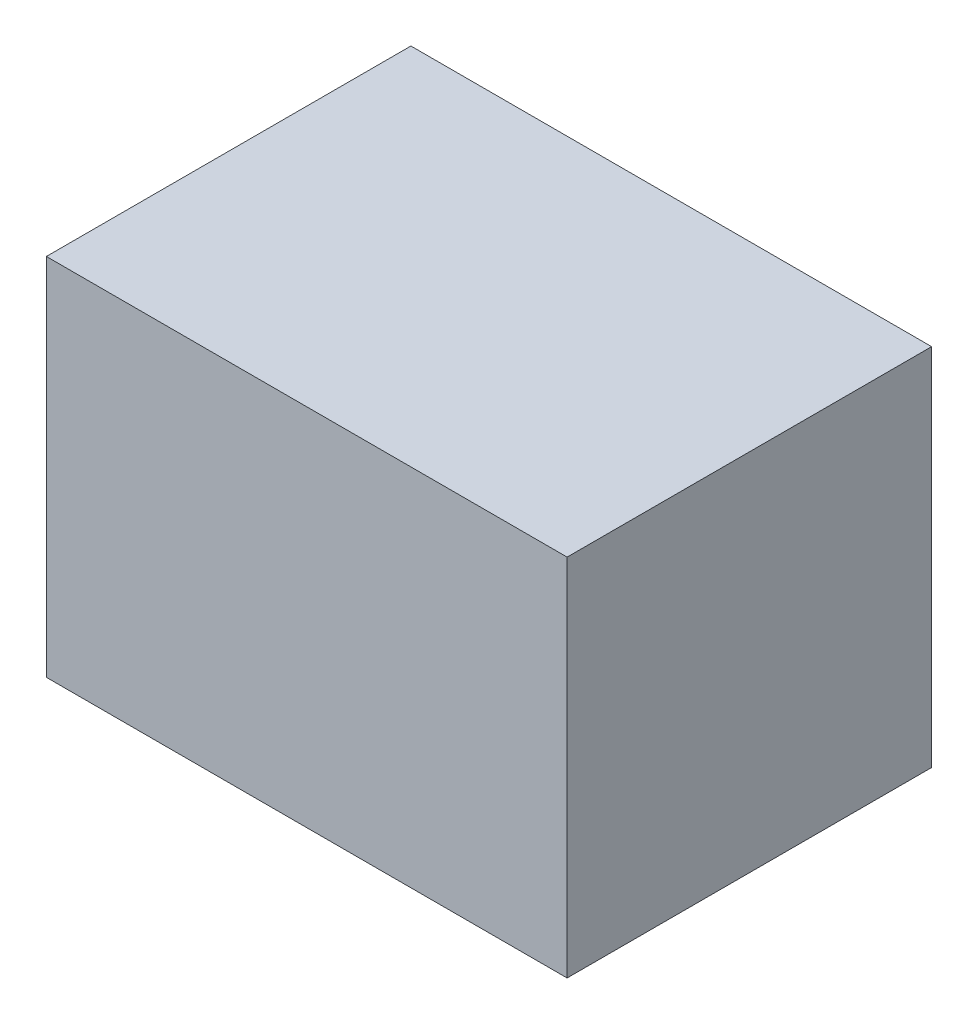
ISO-10303-21;
HEADER;
FILE_DESCRIPTION(('STEP AP214'),'2;1');
FILE_NAME('part.step','',(''),(''),'','','');
FILE_SCHEMA(('AUTOMOTIVE_DESIGN { 1 0 10303 214 1 1 1 1 }'));
ENDSEC;
DATA;
#1=APPLICATION_CONTEXT('core data for automotive mechanical design processes');
#2=APPLICATION_PROTOCOL_DEFINITION('international standard','automotive_design',2000,#1);
#3=PRODUCT_CONTEXT('',#1,'mechanical');
#4=PRODUCT('Part','Part','',(#3));
#5=PRODUCT_RELATED_PRODUCT_CATEGORY('part','',(#4));
#6=PRODUCT_DEFINITION_FORMATION('','',#4);
#7=PRODUCT_DEFINITION_CONTEXT('part definition',#1,'design');
#8=PRODUCT_DEFINITION('design','',#6,#7);
#9=PRODUCT_DEFINITION_SHAPE('','',#8);
#10=(LENGTH_UNIT() NAMED_UNIT(*) SI_UNIT(.MILLI.,.METRE.));
#11=(NAMED_UNIT(*) PLANE_ANGLE_UNIT() SI_UNIT($,.RADIAN.));
#12=(NAMED_UNIT(*) SI_UNIT($,.STERADIAN.) SOLID_ANGLE_UNIT());
#13=UNCERTAINTY_MEASURE_WITH_UNIT(LENGTH_MEASURE(1.E-05),#10,'distance_accuracy_value','');
#14=(GEOMETRIC_REPRESENTATION_CONTEXT(3) GLOBAL_UNCERTAINTY_ASSIGNED_CONTEXT((#13)) GLOBAL_UNIT_ASSIGNED_CONTEXT((#10,
#11,#12)) REPRESENTATION_CONTEXT('',''));
#15=CARTESIAN_POINT('',(0.,0.,0.));
#16=DIRECTION('',(0.,0.,1.));
#17=DIRECTION('',(1.,0.,0.));
#18=AXIS2_PLACEMENT_3D('',#15,#16,#17);
#19=CARTESIAN_POINT('',(-20.32,0.,0.));
#20=DIRECTION('',(0.,-1.,0.));
#21=DIRECTION('',(0.,0.,-1.));
#22=AXIS2_PLACEMENT_3D('',#19,#20,#21);
#23=PLANE('',#22);
#24=DIRECTION('',(1.,0.,0.));
#25=VECTOR('',#24,1.);
#26=CARTESIAN_POINT('',(-20.32,0.,-1.1));
#27=LINE('',#26,#25);
#28=CARTESIAN_POINT('',(-5.33,0.,-1.1));
#29=VERTEX_POINT('',#28);
#30=CARTESIAN_POINT('',(-4.83,0.,-1.1));
#31=VERTEX_POINT('',#30);
#32=EDGE_CURVE('E78',#29,#31,#27,.T.);
#33=ORIENTED_EDGE('',*,*,#32,.F.);
#34=DIRECTION('',(0.,0.,1.));
#35=VECTOR('',#34,1.);
#36=CARTESIAN_POINT('',(-5.33,0.,0.));
#37=LINE('',#36,#35);
#38=CARTESIAN_POINT('',(-5.33,0.,-0.75));
#39=VERTEX_POINT('',#38);
#40=EDGE_CURVE('E20',#29,#39,#37,.T.);
#41=ORIENTED_EDGE('',*,*,#40,.T.);
#42=DIRECTION('',(1.,0.,0.));
#43=VECTOR('',#42,1.);
#44=CARTESIAN_POINT('',(-20.32,0.,-0.75));
#45=LINE('',#44,#43);
#46=CARTESIAN_POINT('',(-4.83,0.,-0.75));
#47=VERTEX_POINT('',#46);
#48=EDGE_CURVE('E112',#39,#47,#45,.T.);
#49=ORIENTED_EDGE('',*,*,#48,.T.);
#50=DIRECTION('',(0.,0.,1.));
#51=VECTOR('',#50,1.);
#52=CARTESIAN_POINT('',(-4.83,0.,0.));
#53=LINE('',#52,#51);
#54=EDGE_CURVE('E82',#31,#47,#53,.T.);
#55=ORIENTED_EDGE('',*,*,#54,.F.);
#56=EDGE_LOOP('',(#33,#41,#49,#55));
#57=FACE_BOUND('',#56,.T.);
#58=ADVANCED_FACE('F17',(#57),#23,.F.);
#59=CARTESIAN_POINT('',(-20.32,-0.35,0.));
#60=DIRECTION('',(0.,-1.,0.));
#61=DIRECTION('',(0.,0.,-1.));
#62=AXIS2_PLACEMENT_3D('',#59,#60,#61);
#63=PLANE('',#62);
#64=DIRECTION('',(1.,0.,0.));
#65=VECTOR('',#64,1.);
#66=CARTESIAN_POINT('',(-20.32,-0.35,-1.1));
#67=LINE('',#66,#65);
#68=CARTESIAN_POINT('',(-5.33,-0.35,-1.1));
#69=VERTEX_POINT('',#68);
#70=CARTESIAN_POINT('',(-4.83,-0.35,-1.1));
#71=VERTEX_POINT('',#70);
#72=EDGE_CURVE('E80',#69,#71,#67,.T.);
#73=ORIENTED_EDGE('',*,*,#72,.T.);
#74=DIRECTION('',(0.,0.,1.));
#75=VECTOR('',#74,1.);
#76=CARTESIAN_POINT('',(-4.83,-0.35,0.));
#77=LINE('',#76,#75);
#78=CARTESIAN_POINT('',(-4.83,-0.35,-0.75));
#79=VERTEX_POINT('',#78);
#80=EDGE_CURVE('E105',#71,#79,#77,.T.);
#81=ORIENTED_EDGE('',*,*,#80,.T.);
#82=DIRECTION('',(1.,0.,0.));
#83=VECTOR('',#82,1.);
#84=CARTESIAN_POINT('',(-20.32,-0.35,-0.75));
#85=LINE('',#84,#83);
#86=CARTESIAN_POINT('',(-5.33,-0.35,-0.75));
#87=VERTEX_POINT('',#86);
#88=EDGE_CURVE('E73',#87,#79,#85,.T.);
#89=ORIENTED_EDGE('',*,*,#88,.F.);
#90=DIRECTION('',(0.,0.,1.));
#91=VECTOR('',#90,1.);
#92=CARTESIAN_POINT('',(-5.33,-0.35,0.));
#93=LINE('',#92,#91);
#94=EDGE_CURVE('E11',#69,#87,#93,.T.);
#95=ORIENTED_EDGE('',*,*,#94,.F.);
#96=EDGE_LOOP('',(#73,#81,#89,#95));
#97=FACE_BOUND('',#96,.T.);
#98=ADVANCED_FACE('F127',(#97),#63,.T.);
#99=CARTESIAN_POINT('',(-5.33,-0.35,0.));
#100=DIRECTION('',(-1.,0.,0.));
#101=DIRECTION('',(0.,0.,1.));
#102=AXIS2_PLACEMENT_3D('',#99,#100,#101);
#103=PLANE('',#102);
#104=ORIENTED_EDGE('',*,*,#40,.F.);
#105=DIRECTION('',(0.,1.,0.));
#106=VECTOR('',#105,1.);
#107=CARTESIAN_POINT('',(-5.33,-0.35,-1.1));
#108=LINE('',#107,#106);
#109=EDGE_CURVE('E67',#69,#29,#108,.T.);
#110=ORIENTED_EDGE('',*,*,#109,.F.);
#111=ORIENTED_EDGE('',*,*,#94,.T.);
#112=DIRECTION('',(0.,1.,0.));
#113=VECTOR('',#112,1.);
#114=CARTESIAN_POINT('',(-5.33,-0.35,-0.75));
#115=LINE('',#114,#113);
#116=EDGE_CURVE('E70',#87,#39,#115,.T.);
#117=ORIENTED_EDGE('',*,*,#116,.T.);
#118=EDGE_LOOP('',(#104,#110,#111,#117));
#119=FACE_BOUND('',#118,.T.);
#120=ADVANCED_FACE('F65',(#119),#103,.T.);
#121=CARTESIAN_POINT('',(-20.32,-0.35,-0.75));
#122=DIRECTION('',(0.,0.,1.));
#123=DIRECTION('',(1.,0.,0.));
#124=AXIS2_PLACEMENT_3D('',#121,#122,#123);
#125=PLANE('',#124);
#126=ORIENTED_EDGE('',*,*,#48,.F.);
#127=ORIENTED_EDGE('',*,*,#116,.F.);
#128=ORIENTED_EDGE('',*,*,#88,.T.);
#129=DIRECTION('',(0.,1.,0.));
#130=VECTOR('',#129,1.);
#131=CARTESIAN_POINT('',(-4.83,-0.35,-0.75));
#132=LINE('',#131,#130);
#133=EDGE_CURVE('E97',#79,#47,#132,.T.);
#134=ORIENTED_EDGE('',*,*,#133,.T.);
#135=EDGE_LOOP('',(#126,#127,#128,#134));
#136=FACE_BOUND('',#135,.T.);
#137=ADVANCED_FACE('F126',(#136),#125,.T.);
#138=CARTESIAN_POINT('',(-4.83,-0.35,0.));
#139=DIRECTION('',(-1.,0.,0.));
#140=DIRECTION('',(0.,0.,1.));
#141=AXIS2_PLACEMENT_3D('',#138,#139,#140);
#142=PLANE('',#141);
#143=ORIENTED_EDGE('',*,*,#54,.T.);
#144=ORIENTED_EDGE('',*,*,#133,.F.);
#145=ORIENTED_EDGE('',*,*,#80,.F.);
#146=DIRECTION('',(0.,1.,0.));
#147=VECTOR('',#146,1.);
#148=CARTESIAN_POINT('',(-4.83,-0.35,-1.1));
#149=LINE('',#148,#147);
#150=EDGE_CURVE('E87',#71,#31,#149,.T.);
#151=ORIENTED_EDGE('',*,*,#150,.T.);
#152=EDGE_LOOP('',(#143,#144,#145,#151));
#153=FACE_BOUND('',#152,.T.);
#154=ADVANCED_FACE('F135',(#153),#142,.F.);
#155=CARTESIAN_POINT('',(-20.32,-0.35,-1.1));
#156=DIRECTION('',(0.,0.,1.));
#157=DIRECTION('',(1.,0.,0.));
#158=AXIS2_PLACEMENT_3D('',#155,#156,#157);
#159=PLANE('',#158);
#160=ORIENTED_EDGE('',*,*,#32,.T.);
#161=ORIENTED_EDGE('',*,*,#150,.F.);
#162=ORIENTED_EDGE('',*,*,#72,.F.);
#163=ORIENTED_EDGE('',*,*,#109,.T.);
#164=EDGE_LOOP('',(#160,#161,#162,#163));
#165=FACE_BOUND('',#164,.T.);
#166=ADVANCED_FACE('F76',(#165),#159,.F.);
#167=CLOSED_SHELL('',(#58,#98,#120,#137,#154,#166));
#168=MANIFOLD_SOLID_BREP('B1',#167);
#169=ADVANCED_BREP_SHAPE_REPRESENTATION('',(#18,#168),#14);
#170=SHAPE_DEFINITION_REPRESENTATION(#9,#169);
ENDSEC;
END-ISO-10303-21;
